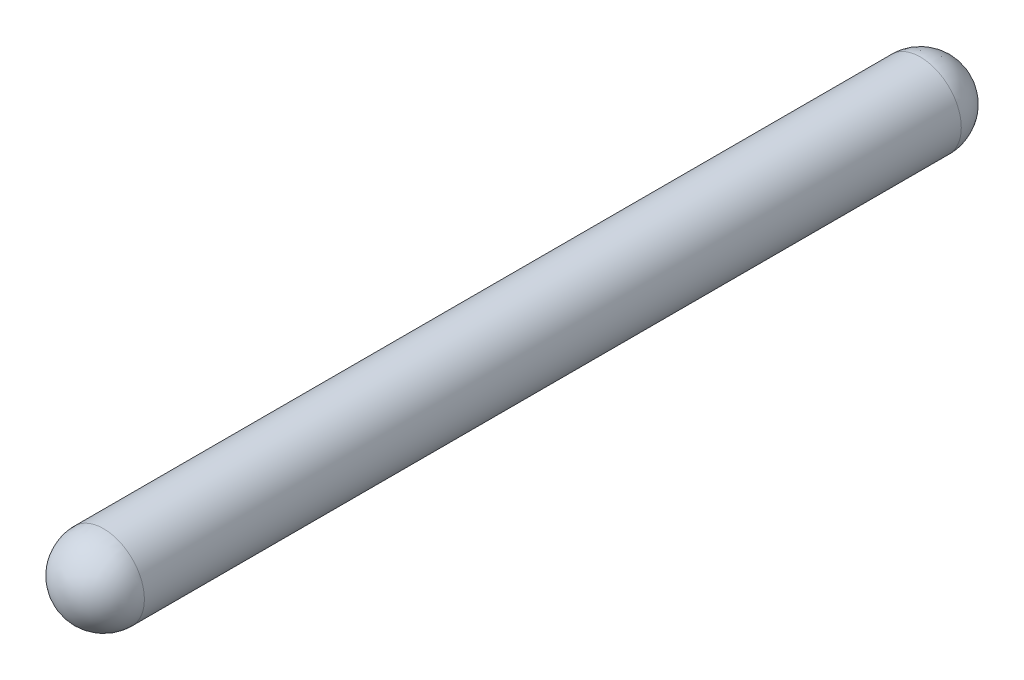
ISO-10303-21;
HEADER;
FILE_DESCRIPTION(('STEP AP214'),'2;1');
FILE_NAME('part.step','',(''),(''),'','','');
FILE_SCHEMA(('AUTOMOTIVE_DESIGN { 1 0 10303 214 1 1 1 1 }'));
ENDSEC;
DATA;
#1=APPLICATION_CONTEXT('core data for automotive mechanical design processes');
#2=APPLICATION_PROTOCOL_DEFINITION('international standard','automotive_design',2000,#1);
#3=PRODUCT_CONTEXT('',#1,'mechanical');
#4=PRODUCT('Part','Part','',(#3));
#5=PRODUCT_RELATED_PRODUCT_CATEGORY('part','',(#4));
#6=PRODUCT_DEFINITION_FORMATION('','',#4);
#7=PRODUCT_DEFINITION_CONTEXT('part definition',#1,'design');
#8=PRODUCT_DEFINITION('design','',#6,#7);
#9=PRODUCT_DEFINITION_SHAPE('','',#8);
#10=(LENGTH_UNIT() NAMED_UNIT(*) SI_UNIT(.MILLI.,.METRE.));
#11=(NAMED_UNIT(*) PLANE_ANGLE_UNIT() SI_UNIT($,.RADIAN.));
#12=(NAMED_UNIT(*) SI_UNIT($,.STERADIAN.) SOLID_ANGLE_UNIT());
#13=UNCERTAINTY_MEASURE_WITH_UNIT(LENGTH_MEASURE(1.E-05),#10,'distance_accuracy_value','');
#14=(GEOMETRIC_REPRESENTATION_CONTEXT(3) GLOBAL_UNCERTAINTY_ASSIGNED_CONTEXT((#13)) GLOBAL_UNIT_ASSIGNED_CONTEXT((#10,
#11,#12)) REPRESENTATION_CONTEXT('',''));
#15=CARTESIAN_POINT('',(0.,0.,0.));
#16=DIRECTION('',(0.,0.,1.));
#17=DIRECTION('',(1.,0.,0.));
#18=AXIS2_PLACEMENT_3D('',#15,#16,#17);
#19=CARTESIAN_POINT('',(2.54,0.,-3.));
#20=DIRECTION('',(1.,0.,0.));
#21=DIRECTION('',(0.,-1.,0.));
#22=AXIS2_PLACEMENT_3D('',#19,#20,#21);
#23=SPHERICAL_SURFACE('',#22,0.25);
#24=CARTESIAN_POINT('',(2.54,0.,-3.));
#25=DIRECTION('',(0.,0.,1.));
#26=DIRECTION('',(1.,0.,0.));
#27=AXIS2_PLACEMENT_3D('',#24,#25,#26);
#28=CIRCLE('',#27,0.25);
#29=CARTESIAN_POINT('',(2.79,0.,-3.));
#30=VERTEX_POINT('',#29);
#31=CARTESIAN_POINT('',(2.29,0.,-3.));
#32=VERTEX_POINT('',#31);
#33=EDGE_CURVE('E42',#30,#32,#28,.T.);
#34=ORIENTED_EDGE('',*,*,#33,.F.);
#35=CARTESIAN_POINT('',(2.54,0.,-3.));
#36=DIRECTION('',(0.,0.,1.));
#37=DIRECTION('',(1.,0.,0.));
#38=AXIS2_PLACEMENT_3D('',#35,#36,#37);
#39=CIRCLE('',#38,0.25);
#40=EDGE_CURVE('E26',#32,#30,#39,.T.);
#41=ORIENTED_EDGE('',*,*,#40,.F.);
#42=EDGE_LOOP('',(#34,#41));
#43=FACE_BOUND('',#42,.T.);
#44=ADVANCED_FACE('F17',(#43),#23,.T.);
#45=CARTESIAN_POINT('',(2.54,0.,2.));
#46=DIRECTION('',(1.,0.,0.));
#47=DIRECTION('',(0.,1.,0.));
#48=AXIS2_PLACEMENT_3D('',#45,#46,#47);
#49=SPHERICAL_SURFACE('',#48,0.25);
#50=CARTESIAN_POINT('',(2.54,0.,2.));
#51=DIRECTION('',(0.,0.,1.));
#52=DIRECTION('',(1.,0.,0.));
#53=AXIS2_PLACEMENT_3D('',#50,#51,#52);
#54=CIRCLE('',#53,0.25);
#55=CARTESIAN_POINT('',(2.79,0.,2.));
#56=VERTEX_POINT('',#55);
#57=CARTESIAN_POINT('',(2.29,0.,2.));
#58=VERTEX_POINT('',#57);
#59=EDGE_CURVE('E11',#56,#58,#54,.F.);
#60=ORIENTED_EDGE('',*,*,#59,.F.);
#61=CARTESIAN_POINT('',(2.54,0.,2.));
#62=DIRECTION('',(0.,0.,1.));
#63=DIRECTION('',(1.,0.,0.));
#64=AXIS2_PLACEMENT_3D('',#61,#62,#63);
#65=CIRCLE('',#64,0.25);
#66=EDGE_CURVE('E34',#58,#56,#65,.F.);
#67=ORIENTED_EDGE('',*,*,#66,.F.);
#68=EDGE_LOOP('',(#60,#67));
#69=FACE_BOUND('',#68,.T.);
#70=ADVANCED_FACE('F49',(#69),#49,.T.);
#71=CARTESIAN_POINT('',(2.54,0.,-3.));
#72=DIRECTION('',(0.,0.,1.));
#73=DIRECTION('',(1.,0.,0.));
#74=AXIS2_PLACEMENT_3D('',#71,#72,#73);
#75=CYLINDRICAL_SURFACE('',#74,0.25);
#76=ORIENTED_EDGE('',*,*,#66,.T.);
#77=ORIENTED_EDGE('',*,*,#59,.T.);
#78=EDGE_LOOP('',(#76,#77));
#79=FACE_BOUND('',#78,.T.);
#80=ORIENTED_EDGE('',*,*,#40,.T.);
#81=ORIENTED_EDGE('',*,*,#33,.T.);
#82=EDGE_LOOP('',(#80,#81));
#83=FACE_BOUND('',#82,.T.);
#84=ADVANCED_FACE('F45',(#79,#83),#75,.T.);
#85=CLOSED_SHELL('',(#44,#70,#84));
#86=MANIFOLD_SOLID_BREP('B1',#85);
#87=ADVANCED_BREP_SHAPE_REPRESENTATION('',(#18,#86),#14);
#88=SHAPE_DEFINITION_REPRESENTATION(#9,#87);
ENDSEC;
END-ISO-10303-21;
